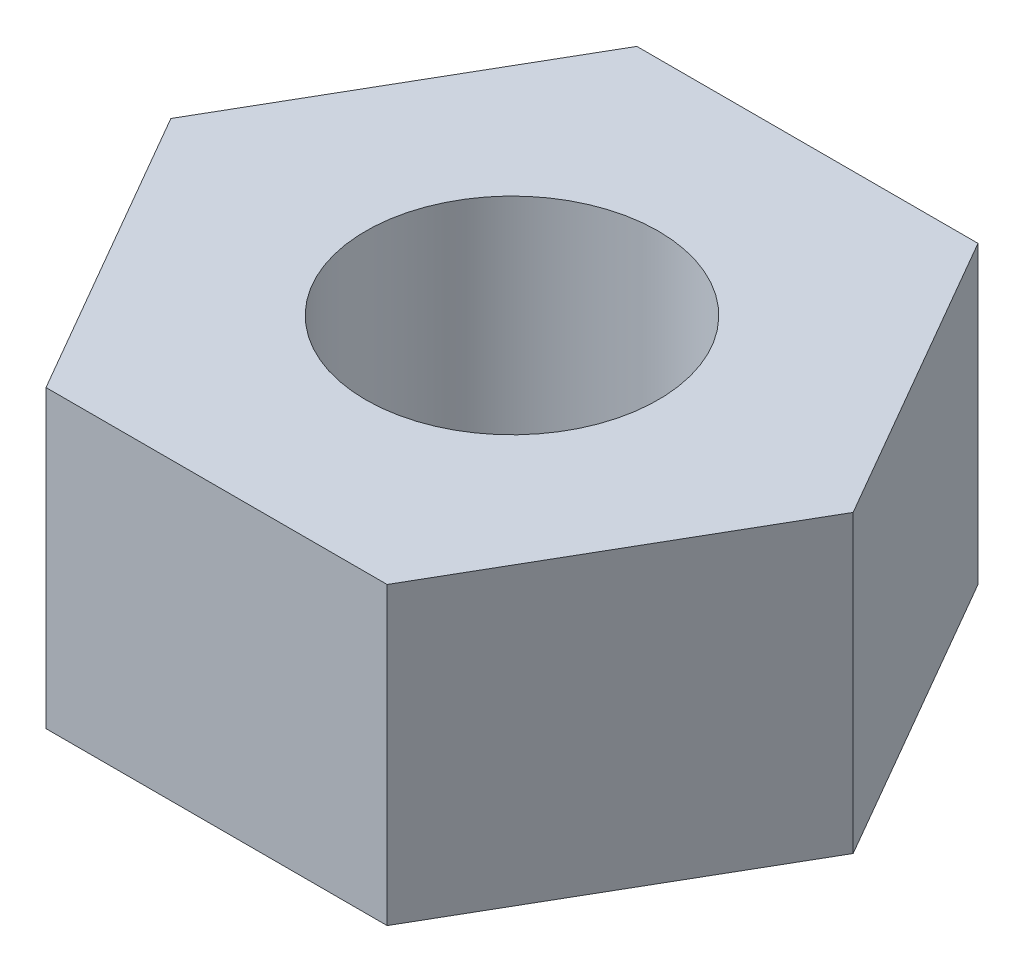
ISO-10303-21;
HEADER;
FILE_DESCRIPTION(('STEP AP214'),'2;1');
FILE_NAME('part.step','',(''),(''),'','','');
FILE_SCHEMA(('AUTOMOTIVE_DESIGN { 1 0 10303 214 1 1 1 1 }'));
ENDSEC;
DATA;
#1=APPLICATION_CONTEXT('core data for automotive mechanical design processes');
#2=APPLICATION_PROTOCOL_DEFINITION('international standard','automotive_design',2000,#1);
#3=PRODUCT_CONTEXT('',#1,'mechanical');
#4=PRODUCT('Part','Part','',(#3));
#5=PRODUCT_RELATED_PRODUCT_CATEGORY('part','',(#4));
#6=PRODUCT_DEFINITION_FORMATION('','',#4);
#7=PRODUCT_DEFINITION_CONTEXT('part definition',#1,'design');
#8=PRODUCT_DEFINITION('design','',#6,#7);
#9=PRODUCT_DEFINITION_SHAPE('','',#8);
#10=(LENGTH_UNIT() NAMED_UNIT(*) SI_UNIT(.MILLI.,.METRE.));
#11=(NAMED_UNIT(*) PLANE_ANGLE_UNIT() SI_UNIT($,.RADIAN.));
#12=(NAMED_UNIT(*) SI_UNIT($,.STERADIAN.) SOLID_ANGLE_UNIT());
#13=UNCERTAINTY_MEASURE_WITH_UNIT(LENGTH_MEASURE(1.E-05),#10,'distance_accuracy_value','');
#14=(GEOMETRIC_REPRESENTATION_CONTEXT(3) GLOBAL_UNCERTAINTY_ASSIGNED_CONTEXT((#13)) GLOBAL_UNIT_ASSIGNED_CONTEXT((#10,
#11,#12)) REPRESENTATION_CONTEXT('',''));
#15=CARTESIAN_POINT('',(0.,0.,0.));
#16=DIRECTION('',(0.,0.,1.));
#17=DIRECTION('',(1.,0.,0.));
#18=AXIS2_PLACEMENT_3D('',#15,#16,#17);
#19=CARTESIAN_POINT('',(1.15470053837925,2.,2.));
#20=DIRECTION('',(-0.866025403784439,0.,-0.5));
#21=DIRECTION('',(-0.5,0.,0.866025403784439));
#22=AXIS2_PLACEMENT_3D('',#19,#20,#21);
#23=PLANE('',#22);
#24=DIRECTION('',(0.5,0.,-0.866025403784439));
#25=VECTOR('',#24,1.);
#26=CARTESIAN_POINT('',(1.15470053837925,0.,2.));
#27=LINE('',#26,#25);
#28=CARTESIAN_POINT('',(1.15470053837925,0.,2.));
#29=VERTEX_POINT('',#28);
#30=CARTESIAN_POINT('',(2.3094010767585,0.,0.));
#31=VERTEX_POINT('',#30);
#32=EDGE_CURVE('E121',#29,#31,#27,.T.);
#33=ORIENTED_EDGE('',*,*,#32,.T.);
#34=DIRECTION('',(0.,-1.,0.));
#35=VECTOR('',#34,1.);
#36=CARTESIAN_POINT('',(2.3094010767585,2.,0.));
#37=LINE('',#36,#35);
#38=CARTESIAN_POINT('',(2.3094010767585,2.,0.));
#39=VERTEX_POINT('',#38);
#40=EDGE_CURVE('E11',#39,#31,#37,.T.);
#41=ORIENTED_EDGE('',*,*,#40,.F.);
#42=DIRECTION('',(0.5,0.,-0.866025403784439));
#43=VECTOR('',#42,1.);
#44=CARTESIAN_POINT('',(1.15470053837925,2.,2.));
#45=LINE('',#44,#43);
#46=CARTESIAN_POINT('',(1.15470053837925,2.,2.));
#47=VERTEX_POINT('',#46);
#48=EDGE_CURVE('E132',#47,#39,#45,.T.);
#49=ORIENTED_EDGE('',*,*,#48,.F.);
#50=DIRECTION('',(0.,-1.,0.));
#51=VECTOR('',#50,1.);
#52=CARTESIAN_POINT('',(1.15470053837925,2.,2.));
#53=LINE('',#52,#51);
#54=EDGE_CURVE('E117',#47,#29,#53,.T.);
#55=ORIENTED_EDGE('',*,*,#54,.T.);
#56=EDGE_LOOP('',(#33,#41,#49,#55));
#57=FACE_BOUND('',#56,.T.);
#58=ADVANCED_FACE('F37',(#57),#23,.F.);
#59=CARTESIAN_POINT('',(2.3094010767585,2.,0.));
#60=DIRECTION('',(-0.866025403784439,0.,0.5));
#61=DIRECTION('',(0.5,0.,0.866025403784439));
#62=AXIS2_PLACEMENT_3D('',#59,#60,#61);
#63=PLANE('',#62);
#64=DIRECTION('',(-0.5,0.,-0.866025403784439));
#65=VECTOR('',#64,1.);
#66=CARTESIAN_POINT('',(2.3094010767585,0.,0.));
#67=LINE('',#66,#65);
#68=CARTESIAN_POINT('',(1.15470053837925,0.,-2.));
#69=VERTEX_POINT('',#68);
#70=EDGE_CURVE('E124',#31,#69,#67,.T.);
#71=ORIENTED_EDGE('',*,*,#70,.T.);
#72=DIRECTION('',(0.,-1.,0.));
#73=VECTOR('',#72,1.);
#74=CARTESIAN_POINT('',(1.15470053837925,2.,-2.));
#75=LINE('',#74,#73);
#76=CARTESIAN_POINT('',(1.15470053837925,2.,-2.));
#77=VERTEX_POINT('',#76);
#78=EDGE_CURVE('E45',#77,#69,#75,.T.);
#79=ORIENTED_EDGE('',*,*,#78,.F.);
#80=DIRECTION('',(-0.5,0.,-0.866025403784439));
#81=VECTOR('',#80,1.);
#82=CARTESIAN_POINT('',(2.3094010767585,2.,0.));
#83=LINE('',#82,#81);
#84=EDGE_CURVE('E90',#39,#77,#83,.T.);
#85=ORIENTED_EDGE('',*,*,#84,.F.);
#86=ORIENTED_EDGE('',*,*,#40,.T.);
#87=EDGE_LOOP('',(#71,#79,#85,#86));
#88=FACE_BOUND('',#87,.T.);
#89=ADVANCED_FACE('F157',(#88),#63,.F.);
#90=CARTESIAN_POINT('',(1.15470053837925,2.,-2.));
#91=DIRECTION('',(0.,0.,1.));
#92=DIRECTION('',(1.,0.,0.));
#93=AXIS2_PLACEMENT_3D('',#90,#91,#92);
#94=PLANE('',#93);
#95=DIRECTION('',(-1.,0.,0.));
#96=VECTOR('',#95,1.);
#97=CARTESIAN_POINT('',(1.15470053837925,0.,-2.));
#98=LINE('',#97,#96);
#99=CARTESIAN_POINT('',(-1.15470053837925,0.,-2.00000000000001));
#100=VERTEX_POINT('',#99);
#101=EDGE_CURVE('E127',#69,#100,#98,.T.);
#102=ORIENTED_EDGE('',*,*,#101,.T.);
#103=DIRECTION('',(0.,-1.,0.));
#104=VECTOR('',#103,1.);
#105=CARTESIAN_POINT('',(-1.15470053837925,2.,-2.00000000000001));
#106=LINE('',#105,#104);
#107=CARTESIAN_POINT('',(-1.15470053837925,2.,-2.00000000000001));
#108=VERTEX_POINT('',#107);
#109=EDGE_CURVE('E112',#108,#100,#106,.T.);
#110=ORIENTED_EDGE('',*,*,#109,.F.);
#111=DIRECTION('',(-1.,0.,0.));
#112=VECTOR('',#111,1.);
#113=CARTESIAN_POINT('',(1.15470053837925,2.,-2.));
#114=LINE('',#113,#112);
#115=EDGE_CURVE('E103',#77,#108,#114,.T.);
#116=ORIENTED_EDGE('',*,*,#115,.F.);
#117=ORIENTED_EDGE('',*,*,#78,.T.);
#118=EDGE_LOOP('',(#102,#110,#116,#117));
#119=FACE_BOUND('',#118,.T.);
#120=ADVANCED_FACE('F138',(#119),#94,.F.);
#121=CARTESIAN_POINT('',(-1.15470053837925,2.,-2.00000000000001));
#122=DIRECTION('',(0.866025403784439,0.,0.5));
#123=DIRECTION('',(0.5,0.,-0.866025403784439));
#124=AXIS2_PLACEMENT_3D('',#121,#122,#123);
#125=PLANE('',#124);
#126=DIRECTION('',(-0.5,0.,0.866025403784439));
#127=VECTOR('',#126,1.);
#128=CARTESIAN_POINT('',(-1.15470053837925,0.,-2.00000000000001));
#129=LINE('',#128,#127);
#130=CARTESIAN_POINT('',(-2.30940107675851,0.,0.));
#131=VERTEX_POINT('',#130);
#132=EDGE_CURVE('E111',#100,#131,#129,.T.);
#133=ORIENTED_EDGE('',*,*,#132,.T.);
#134=DIRECTION('',(0.,-1.,0.));
#135=VECTOR('',#134,1.);
#136=CARTESIAN_POINT('',(-2.30940107675851,2.,0.));
#137=LINE('',#136,#135);
#138=CARTESIAN_POINT('',(-2.30940107675851,2.,0.));
#139=VERTEX_POINT('',#138);
#140=EDGE_CURVE('E108',#139,#131,#137,.T.);
#141=ORIENTED_EDGE('',*,*,#140,.F.);
#142=DIRECTION('',(-0.5,0.,0.866025403784439));
#143=VECTOR('',#142,1.);
#144=CARTESIAN_POINT('',(-1.15470053837925,2.,-2.00000000000001));
#145=LINE('',#144,#143);
#146=EDGE_CURVE('E97',#108,#139,#145,.T.);
#147=ORIENTED_EDGE('',*,*,#146,.F.);
#148=ORIENTED_EDGE('',*,*,#109,.T.);
#149=EDGE_LOOP('',(#133,#141,#147,#148));
#150=FACE_BOUND('',#149,.T.);
#151=ADVANCED_FACE('F109',(#150),#125,.F.);
#152=CARTESIAN_POINT('',(-2.30940107675851,2.,0.));
#153=DIRECTION('',(0.866025403784438,0.,-0.5));
#154=DIRECTION('',(-0.5,0.,-0.866025403784439));
#155=AXIS2_PLACEMENT_3D('',#152,#153,#154);
#156=PLANE('',#155);
#157=DIRECTION('',(0.5,0.,0.866025403784438));
#158=VECTOR('',#157,1.);
#159=CARTESIAN_POINT('',(-2.30940107675851,0.,0.));
#160=LINE('',#159,#158);
#161=CARTESIAN_POINT('',(-1.15470053837925,0.,2.));
#162=VERTEX_POINT('',#161);
#163=EDGE_CURVE('E76',#131,#162,#160,.T.);
#164=ORIENTED_EDGE('',*,*,#163,.T.);
#165=DIRECTION('',(0.,-1.,0.));
#166=VECTOR('',#165,1.);
#167=CARTESIAN_POINT('',(-1.15470053837925,2.,2.));
#168=LINE('',#167,#166);
#169=CARTESIAN_POINT('',(-1.15470053837925,2.,2.));
#170=VERTEX_POINT('',#169);
#171=EDGE_CURVE('E113',#170,#162,#168,.T.);
#172=ORIENTED_EDGE('',*,*,#171,.F.);
#173=DIRECTION('',(0.5,0.,0.866025403784438));
#174=VECTOR('',#173,1.);
#175=CARTESIAN_POINT('',(-2.30940107675851,2.,0.));
#176=LINE('',#175,#174);
#177=EDGE_CURVE('E101',#139,#170,#176,.T.);
#178=ORIENTED_EDGE('',*,*,#177,.F.);
#179=ORIENTED_EDGE('',*,*,#140,.T.);
#180=EDGE_LOOP('',(#164,#172,#178,#179));
#181=FACE_BOUND('',#180,.T.);
#182=ADVANCED_FACE('F115',(#181),#156,.F.);
#183=CARTESIAN_POINT('',(-1.15470053837925,2.,2.));
#184=DIRECTION('',(0.,0.,-1.));
#185=DIRECTION('',(-1.,0.,0.));
#186=AXIS2_PLACEMENT_3D('',#183,#184,#185);
#187=PLANE('',#186);
#188=DIRECTION('',(1.,0.,0.));
#189=VECTOR('',#188,1.);
#190=CARTESIAN_POINT('',(-1.15470053837925,0.,2.));
#191=LINE('',#190,#189);
#192=EDGE_CURVE('E82',#162,#29,#191,.T.);
#193=ORIENTED_EDGE('',*,*,#192,.T.);
#194=ORIENTED_EDGE('',*,*,#54,.F.);
#195=DIRECTION('',(1.,0.,0.));
#196=VECTOR('',#195,1.);
#197=CARTESIAN_POINT('',(-1.15470053837925,2.,2.));
#198=LINE('',#197,#196);
#199=EDGE_CURVE('E53',#170,#47,#198,.T.);
#200=ORIENTED_EDGE('',*,*,#199,.F.);
#201=ORIENTED_EDGE('',*,*,#171,.T.);
#202=EDGE_LOOP('',(#193,#194,#200,#201));
#203=FACE_BOUND('',#202,.T.);
#204=ADVANCED_FACE('F145',(#203),#187,.F.);
#205=CARTESIAN_POINT('',(0.,2.,0.));
#206=DIRECTION('',(0.,1.,0.));
#207=DIRECTION('',(0.,0.,1.));
#208=AXIS2_PLACEMENT_3D('',#205,#206,#207);
#209=PLANE('',#208);
#210=CARTESIAN_POINT('',(0.,2.,0.));
#211=DIRECTION('',(0.,1.,0.));
#212=DIRECTION('',(0.,0.,1.));
#213=AXIS2_PLACEMENT_3D('',#210,#211,#212);
#214=CIRCLE('',#213,0.99);
#215=CARTESIAN_POINT('',(0.,2.,0.99));
#216=VERTEX_POINT('',#215);
#217=EDGE_CURVE('E125',#216,#216,#214,.T.);
#218=ORIENTED_EDGE('',*,*,#217,.F.);
#219=EDGE_LOOP('',(#218));
#220=FACE_BOUND('',#219,.T.);
#221=ORIENTED_EDGE('',*,*,#48,.T.);
#222=ORIENTED_EDGE('',*,*,#84,.T.);
#223=ORIENTED_EDGE('',*,*,#115,.T.);
#224=ORIENTED_EDGE('',*,*,#146,.T.);
#225=ORIENTED_EDGE('',*,*,#177,.T.);
#226=ORIENTED_EDGE('',*,*,#199,.T.);
#227=EDGE_LOOP('',(#221,#222,#223,#224,#225,#226));
#228=FACE_BOUND('',#227,.T.);
#229=ADVANCED_FACE('F99',(#220,#228),#209,.T.);
#230=CARTESIAN_POINT('',(0.,0.,0.));
#231=DIRECTION('',(0.,1.,0.));
#232=DIRECTION('',(0.,0.,1.));
#233=AXIS2_PLACEMENT_3D('',#230,#231,#232);
#234=PLANE('',#233);
#235=CARTESIAN_POINT('',(0.,0.,0.));
#236=DIRECTION('',(0.,1.,0.));
#237=DIRECTION('',(0.,0.,1.));
#238=AXIS2_PLACEMENT_3D('',#235,#236,#237);
#239=CIRCLE('',#238,0.99);
#240=CARTESIAN_POINT('',(0.,0.,0.99));
#241=VERTEX_POINT('',#240);
#242=EDGE_CURVE('E212',#241,#241,#239,.T.);
#243=ORIENTED_EDGE('',*,*,#242,.T.);
#244=EDGE_LOOP('',(#243));
#245=FACE_BOUND('',#244,.T.);
#246=ORIENTED_EDGE('',*,*,#32,.F.);
#247=ORIENTED_EDGE('',*,*,#192,.F.);
#248=ORIENTED_EDGE('',*,*,#163,.F.);
#249=ORIENTED_EDGE('',*,*,#132,.F.);
#250=ORIENTED_EDGE('',*,*,#101,.F.);
#251=ORIENTED_EDGE('',*,*,#70,.F.);
#252=EDGE_LOOP('',(#246,#247,#248,#249,#250,#251));
#253=FACE_BOUND('',#252,.T.);
#254=ADVANCED_FACE('F141',(#245,#253),#234,.F.);
#255=CARTESIAN_POINT('',(0.,2.,0.));
#256=DIRECTION('',(0.,-1.,0.));
#257=DIRECTION('',(0.,0.,-1.));
#258=AXIS2_PLACEMENT_3D('',#255,#256,#257);
#259=CYLINDRICAL_SURFACE('',#258,0.99);
#260=ORIENTED_EDGE('',*,*,#217,.T.);
#261=EDGE_LOOP('',(#260));
#262=FACE_BOUND('',#261,.T.);
#263=ORIENTED_EDGE('',*,*,#242,.F.);
#264=EDGE_LOOP('',(#263));
#265=FACE_BOUND('',#264,.T.);
#266=ADVANCED_FACE('F194',(#262,#265),#259,.F.);
#267=CLOSED_SHELL('',(#58,#89,#120,#151,#182,#204,#229,#254,#266));
#268=MANIFOLD_SOLID_BREP('B2',#267);
#269=ADVANCED_BREP_SHAPE_REPRESENTATION('',(#18,#268),#14);
#270=SHAPE_DEFINITION_REPRESENTATION(#9,#269);
ENDSEC;
END-ISO-10303-21;
